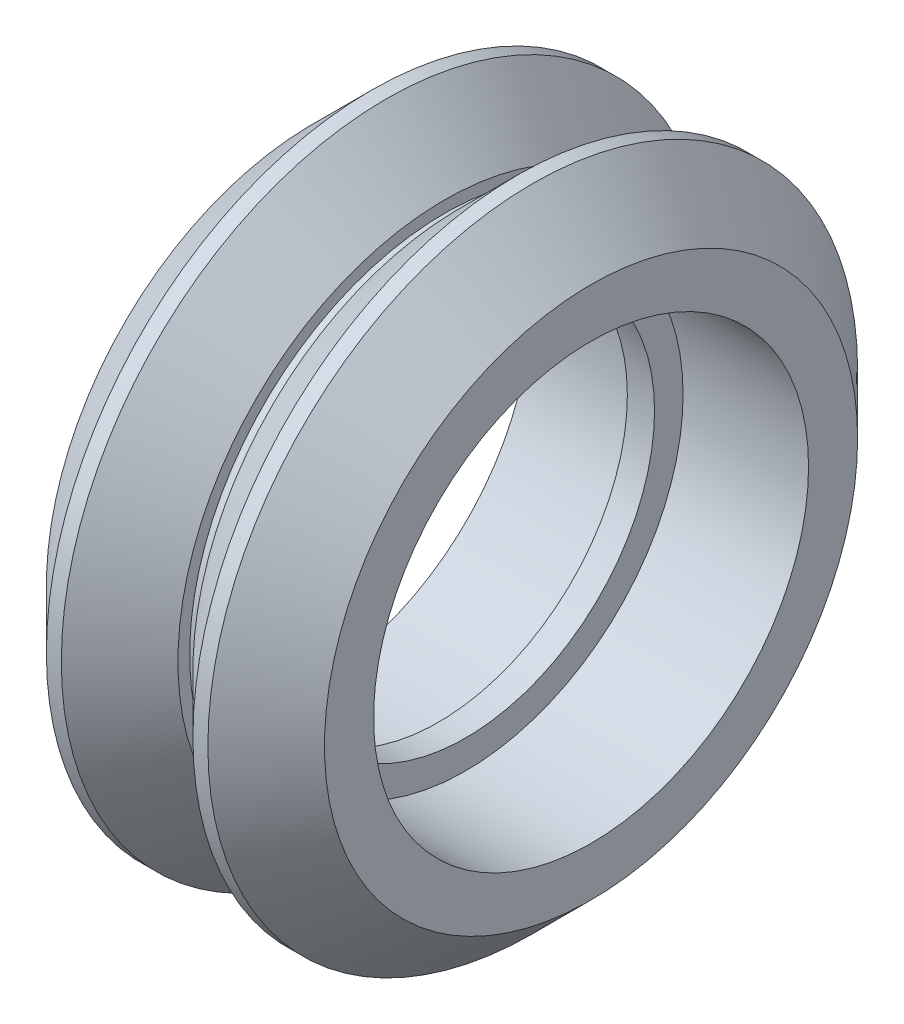
ISO-10303-21;
HEADER;
FILE_DESCRIPTION(('STEP AP214'),'2;1');
FILE_NAME('part.step','',(''),(''),'','','');
FILE_SCHEMA(('AUTOMOTIVE_DESIGN { 1 0 10303 214 1 1 1 1 }'));
ENDSEC;
DATA;
#1=APPLICATION_CONTEXT('core data for automotive mechanical design processes');
#2=APPLICATION_PROTOCOL_DEFINITION('international standard','automotive_design',2000,#1);
#3=PRODUCT_CONTEXT('',#1,'mechanical');
#4=PRODUCT('Part','Part','',(#3));
#5=PRODUCT_RELATED_PRODUCT_CATEGORY('part','',(#4));
#6=PRODUCT_DEFINITION_FORMATION('','',#4);
#7=PRODUCT_DEFINITION_CONTEXT('part definition',#1,'design');
#8=PRODUCT_DEFINITION('design','',#6,#7);
#9=PRODUCT_DEFINITION_SHAPE('','',#8);
#10=(LENGTH_UNIT() NAMED_UNIT(*) SI_UNIT(.MILLI.,.METRE.));
#11=(NAMED_UNIT(*) PLANE_ANGLE_UNIT() SI_UNIT($,.RADIAN.));
#12=(NAMED_UNIT(*) SI_UNIT($,.STERADIAN.) SOLID_ANGLE_UNIT());
#13=UNCERTAINTY_MEASURE_WITH_UNIT(LENGTH_MEASURE(1.E-05),#10,'distance_accuracy_value','');
#14=(GEOMETRIC_REPRESENTATION_CONTEXT(3) GLOBAL_UNCERTAINTY_ASSIGNED_CONTEXT((#13)) GLOBAL_UNIT_ASSIGNED_CONTEXT((#10,
#11,#12)) REPRESENTATION_CONTEXT('',''));
#15=CARTESIAN_POINT('',(0.,0.,0.));
#16=DIRECTION('',(0.,0.,1.));
#17=DIRECTION('',(1.,0.,0.));
#18=AXIS2_PLACEMENT_3D('',#15,#16,#17);
#19=CARTESIAN_POINT('',(-0.499999999999999,6.95,0.));
#20=DIRECTION('',(-1.,0.,0.));
#21=DIRECTION('',(0.,0.,1.));
#22=AXIS2_PLACEMENT_3D('',#19,#20,#21);
#23=PLANE('',#22);
#24=CARTESIAN_POINT('',(-0.499999999999999,0.,0.));
#25=DIRECTION('',(1.,0.,0.));
#26=DIRECTION('',(0.,0.,-1.));
#27=AXIS2_PLACEMENT_3D('',#24,#25,#26);
#28=CIRCLE('',#27,6.95);
#29=CARTESIAN_POINT('',(-0.499999999999999,0.,-6.95));
#30=VERTEX_POINT('',#29);
#31=EDGE_CURVE('E10',#30,#30,#28,.T.);
#32=ORIENTED_EDGE('',*,*,#31,.T.);
#33=EDGE_LOOP('',(#32));
#34=FACE_BOUND('',#33,.T.);
#35=CARTESIAN_POINT('',(-0.499999999999999,0.,0.));
#36=DIRECTION('',(1.,0.,0.));
#37=DIRECTION('',(0.,0.,-1.));
#38=AXIS2_PLACEMENT_3D('',#35,#36,#37);
#39=CIRCLE('',#38,8.);
#40=CARTESIAN_POINT('',(-0.499999999999999,0.,-8.));
#41=VERTEX_POINT('',#40);
#42=EDGE_CURVE('E84',#41,#41,#39,.T.);
#43=ORIENTED_EDGE('',*,*,#42,.F.);
#44=EDGE_LOOP('',(#43));
#45=FACE_BOUND('',#44,.T.);
#46=ADVANCED_FACE('F32',(#34,#45),#23,.T.);
#47=CARTESIAN_POINT('',(0.,0.,0.));
#48=DIRECTION('',(1.,0.,0.));
#49=DIRECTION('',(0.,0.,-1.));
#50=AXIS2_PLACEMENT_3D('',#47,#48,#49);
#51=CYLINDRICAL_SURFACE('',#50,6.95);
#52=CARTESIAN_POINT('',(0.500000000000001,0.,0.));
#53=DIRECTION('',(1.,0.,0.));
#54=DIRECTION('',(0.,0.,-1.));
#55=AXIS2_PLACEMENT_3D('',#52,#53,#54);
#56=CIRCLE('',#55,6.95);
#57=CARTESIAN_POINT('',(0.500000000000001,0.,-6.95));
#58=VERTEX_POINT('',#57);
#59=EDGE_CURVE('E38',#58,#58,#56,.T.);
#60=ORIENTED_EDGE('',*,*,#59,.T.);
#61=EDGE_LOOP('',(#60));
#62=FACE_BOUND('',#61,.T.);
#63=ORIENTED_EDGE('',*,*,#31,.F.);
#64=EDGE_LOOP('',(#63));
#65=FACE_BOUND('',#64,.T.);
#66=ADVANCED_FACE('F92',(#62,#65),#51,.F.);
#67=CARTESIAN_POINT('',(0.500000000000001,6.95,0.));
#68=DIRECTION('',(1.,0.,0.));
#69=DIRECTION('',(0.,0.,-1.));
#70=AXIS2_PLACEMENT_3D('',#67,#68,#69);
#71=PLANE('',#70);
#72=CARTESIAN_POINT('',(0.5,0.,0.));
#73=DIRECTION('',(1.,0.,0.));
#74=DIRECTION('',(0.,0.,-1.));
#75=AXIS2_PLACEMENT_3D('',#72,#73,#74);
#76=CIRCLE('',#75,8.);
#77=CARTESIAN_POINT('',(0.5,0.,-8.));
#78=VERTEX_POINT('',#77);
#79=EDGE_CURVE('E42',#78,#78,#76,.T.);
#80=ORIENTED_EDGE('',*,*,#79,.T.);
#81=EDGE_LOOP('',(#80));
#82=FACE_BOUND('',#81,.T.);
#83=ORIENTED_EDGE('',*,*,#59,.F.);
#84=EDGE_LOOP('',(#83));
#85=FACE_BOUND('',#84,.T.);
#86=ADVANCED_FACE('F96',(#82,#85),#71,.T.);
#87=CARTESIAN_POINT('',(0.,0.,0.));
#88=DIRECTION('',(1.,0.,0.));
#89=DIRECTION('',(0.,0.,-1.));
#90=AXIS2_PLACEMENT_3D('',#87,#88,#89);
#91=CYLINDRICAL_SURFACE('',#90,8.);
#92=CARTESIAN_POINT('',(5.115,0.,0.));
#93=DIRECTION('',(1.,0.,0.));
#94=DIRECTION('',(0.,0.,-1.));
#95=AXIS2_PLACEMENT_3D('',#92,#93,#94);
#96=CIRCLE('',#95,8.);
#97=CARTESIAN_POINT('',(5.115,0.,-8.));
#98=VERTEX_POINT('',#97);
#99=EDGE_CURVE('E46',#98,#98,#96,.T.);
#100=ORIENTED_EDGE('',*,*,#99,.T.);
#101=EDGE_LOOP('',(#100));
#102=FACE_BOUND('',#101,.T.);
#103=ORIENTED_EDGE('',*,*,#79,.F.);
#104=EDGE_LOOP('',(#103));
#105=FACE_BOUND('',#104,.T.);
#106=ADVANCED_FACE('F100',(#102,#105),#91,.F.);
#107=CARTESIAN_POINT('',(5.115,8.,0.));
#108=DIRECTION('',(1.,0.,0.));
#109=DIRECTION('',(0.,0.,-1.));
#110=AXIS2_PLACEMENT_3D('',#107,#108,#109);
#111=PLANE('',#110);
#112=CARTESIAN_POINT('',(5.115,0.,0.));
#113=DIRECTION('',(1.,0.,0.));
#114=DIRECTION('',(0.,0.,-1.));
#115=AXIS2_PLACEMENT_3D('',#112,#113,#114);
#116=CIRCLE('',#115,9.805);
#117=CARTESIAN_POINT('',(5.115,0.,-9.805));
#118=VERTEX_POINT('',#117);
#119=EDGE_CURVE('E51',#118,#118,#116,.T.);
#120=ORIENTED_EDGE('',*,*,#119,.T.);
#121=EDGE_LOOP('',(#120));
#122=FACE_BOUND('',#121,.T.);
#123=ORIENTED_EDGE('',*,*,#99,.F.);
#124=EDGE_LOOP('',(#123));
#125=FACE_BOUND('',#124,.T.);
#126=ADVANCED_FACE('F107',(#122,#125),#111,.T.);
#127=CARTESIAN_POINT('',(5.115,0.,0.));
#128=DIRECTION('',(-1.,0.,0.));
#129=DIRECTION('',(0.,0.,1.));
#130=AXIS2_PLACEMENT_3D('',#127,#128,#129);
#131=CONICAL_SURFACE('',#130,9.805,0.785398163397447);
#132=CARTESIAN_POINT('',(2.96999999999999,0.,0.));
#133=DIRECTION('',(1.,0.,0.));
#134=DIRECTION('',(0.,0.,-1.));
#135=AXIS2_PLACEMENT_3D('',#132,#133,#134);
#136=CIRCLE('',#135,11.95);
#137=CARTESIAN_POINT('',(2.96999999999999,0.,-11.95));
#138=VERTEX_POINT('',#137);
#139=EDGE_CURVE('E54',#138,#138,#136,.T.);
#140=ORIENTED_EDGE('',*,*,#139,.T.);
#141=EDGE_LOOP('',(#140));
#142=FACE_BOUND('',#141,.T.);
#143=ORIENTED_EDGE('',*,*,#119,.F.);
#144=EDGE_LOOP('',(#143));
#145=FACE_BOUND('',#144,.T.);
#146=ADVANCED_FACE('F111',(#142,#145),#131,.T.);
#147=CARTESIAN_POINT('',(0.,0.,0.));
#148=DIRECTION('',(1.,0.,0.));
#149=DIRECTION('',(0.,0.,-1.));
#150=AXIS2_PLACEMENT_3D('',#147,#148,#149);
#151=CYLINDRICAL_SURFACE('',#150,11.95);
#152=CARTESIAN_POINT('',(2.41999999999999,0.,0.));
#153=DIRECTION('',(1.,0.,0.));
#154=DIRECTION('',(0.,0.,-1.));
#155=AXIS2_PLACEMENT_3D('',#152,#153,#154);
#156=CIRCLE('',#155,11.95);
#157=CARTESIAN_POINT('',(2.41999999999999,0.,-11.95));
#158=VERTEX_POINT('',#157);
#159=EDGE_CURVE('E57',#158,#158,#156,.T.);
#160=ORIENTED_EDGE('',*,*,#159,.T.);
#161=EDGE_LOOP('',(#160));
#162=FACE_BOUND('',#161,.T.);
#163=ORIENTED_EDGE('',*,*,#139,.F.);
#164=EDGE_LOOP('',(#163));
#165=FACE_BOUND('',#164,.T.);
#166=ADVANCED_FACE('F115',(#162,#165),#151,.T.);
#167=CARTESIAN_POINT('',(2.41999999999999,0.,0.));
#168=DIRECTION('',(1.,0.,0.));
#169=DIRECTION('',(0.,0.,-1.));
#170=AXIS2_PLACEMENT_3D('',#167,#168,#169);
#171=CONICAL_SURFACE('',#170,11.95,0.785398163397449);
#172=CARTESIAN_POINT('',(0.274999999999998,0.,0.));
#173=DIRECTION('',(1.,0.,0.));
#174=DIRECTION('',(0.,0.,-1.));
#175=AXIS2_PLACEMENT_3D('',#172,#173,#174);
#176=CIRCLE('',#175,9.805);
#177=CARTESIAN_POINT('',(0.274999999999998,0.,-9.805));
#178=VERTEX_POINT('',#177);
#179=EDGE_CURVE('E60',#178,#178,#176,.T.);
#180=ORIENTED_EDGE('',*,*,#179,.T.);
#181=EDGE_LOOP('',(#180));
#182=FACE_BOUND('',#181,.T.);
#183=ORIENTED_EDGE('',*,*,#159,.F.);
#184=EDGE_LOOP('',(#183));
#185=FACE_BOUND('',#184,.T.);
#186=ADVANCED_FACE('F119',(#182,#185),#171,.T.);
#187=CARTESIAN_POINT('',(0.275,9.805,0.));
#188=DIRECTION('',(-1.,0.,0.));
#189=DIRECTION('',(0.,0.,1.));
#190=AXIS2_PLACEMENT_3D('',#187,#188,#189);
#191=PLANE('',#190);
#192=CARTESIAN_POINT('',(0.275000000000003,0.,0.));
#193=DIRECTION('',(1.,0.,0.));
#194=DIRECTION('',(0.,0.,-1.));
#195=AXIS2_PLACEMENT_3D('',#192,#193,#194);
#196=CIRCLE('',#195,9.375);
#197=CARTESIAN_POINT('',(0.275000000000003,0.,-9.375));
#198=VERTEX_POINT('',#197);
#199=EDGE_CURVE('E63',#198,#198,#196,.T.);
#200=ORIENTED_EDGE('',*,*,#199,.T.);
#201=EDGE_LOOP('',(#200));
#202=FACE_BOUND('',#201,.T.);
#203=ORIENTED_EDGE('',*,*,#179,.F.);
#204=EDGE_LOOP('',(#203));
#205=FACE_BOUND('',#204,.T.);
#206=ADVANCED_FACE('F123',(#202,#205),#191,.T.);
#207=CARTESIAN_POINT('',(0.,0.,0.));
#208=DIRECTION('',(1.,0.,0.));
#209=DIRECTION('',(0.,0.,-1.));
#210=AXIS2_PLACEMENT_3D('',#207,#208,#209);
#211=CYLINDRICAL_SURFACE('',#210,9.375);
#212=CARTESIAN_POINT('',(-0.274999999999998,0.,0.));
#213=DIRECTION('',(1.,0.,0.));
#214=DIRECTION('',(0.,0.,-1.));
#215=AXIS2_PLACEMENT_3D('',#212,#213,#214);
#216=CIRCLE('',#215,9.375);
#217=CARTESIAN_POINT('',(-0.274999999999998,0.,-9.375));
#218=VERTEX_POINT('',#217);
#219=EDGE_CURVE('E66',#218,#218,#216,.T.);
#220=ORIENTED_EDGE('',*,*,#219,.T.);
#221=EDGE_LOOP('',(#220));
#222=FACE_BOUND('',#221,.T.);
#223=ORIENTED_EDGE('',*,*,#199,.F.);
#224=EDGE_LOOP('',(#223));
#225=FACE_BOUND('',#224,.T.);
#226=ADVANCED_FACE('F127',(#222,#225),#211,.T.);
#227=CARTESIAN_POINT('',(-0.274999999999998,9.805,0.));
#228=DIRECTION('',(1.,0.,0.));
#229=DIRECTION('',(0.,0.,-1.));
#230=AXIS2_PLACEMENT_3D('',#227,#228,#229);
#231=PLANE('',#230);
#232=CARTESIAN_POINT('',(-0.274999999999998,0.,0.));
#233=DIRECTION('',(1.,0.,0.));
#234=DIRECTION('',(0.,0.,-1.));
#235=AXIS2_PLACEMENT_3D('',#232,#233,#234);
#236=CIRCLE('',#235,9.805);
#237=CARTESIAN_POINT('',(-0.274999999999998,0.,-9.805));
#238=VERTEX_POINT('',#237);
#239=EDGE_CURVE('E69',#238,#238,#236,.T.);
#240=ORIENTED_EDGE('',*,*,#239,.T.);
#241=EDGE_LOOP('',(#240));
#242=FACE_BOUND('',#241,.T.);
#243=ORIENTED_EDGE('',*,*,#219,.F.);
#244=EDGE_LOOP('',(#243));
#245=FACE_BOUND('',#244,.T.);
#246=ADVANCED_FACE('F131',(#242,#245),#231,.T.);
#247=CARTESIAN_POINT('',(-0.274999999999998,0.,0.));
#248=DIRECTION('',(-1.,0.,0.));
#249=DIRECTION('',(0.,0.,1.));
#250=AXIS2_PLACEMENT_3D('',#247,#248,#249);
#251=CONICAL_SURFACE('',#250,9.805,0.785398163397449);
#252=CARTESIAN_POINT('',(-2.41999999999999,0.,0.));
#253=DIRECTION('',(1.,0.,0.));
#254=DIRECTION('',(0.,0.,-1.));
#255=AXIS2_PLACEMENT_3D('',#252,#253,#254);
#256=CIRCLE('',#255,11.95);
#257=CARTESIAN_POINT('',(-2.41999999999999,0.,-11.95));
#258=VERTEX_POINT('',#257);
#259=EDGE_CURVE('E72',#258,#258,#256,.T.);
#260=ORIENTED_EDGE('',*,*,#259,.T.);
#261=EDGE_LOOP('',(#260));
#262=FACE_BOUND('',#261,.T.);
#263=ORIENTED_EDGE('',*,*,#239,.F.);
#264=EDGE_LOOP('',(#263));
#265=FACE_BOUND('',#264,.T.);
#266=ADVANCED_FACE('F135',(#262,#265),#251,.T.);
#267=CARTESIAN_POINT('',(0.,0.,0.));
#268=DIRECTION('',(1.,0.,0.));
#269=DIRECTION('',(0.,0.,-1.));
#270=AXIS2_PLACEMENT_3D('',#267,#268,#269);
#271=CYLINDRICAL_SURFACE('',#270,11.95);
#272=CARTESIAN_POINT('',(-2.96999999999999,0.,0.));
#273=DIRECTION('',(1.,0.,0.));
#274=DIRECTION('',(0.,0.,-1.));
#275=AXIS2_PLACEMENT_3D('',#272,#273,#274);
#276=CIRCLE('',#275,11.95);
#277=CARTESIAN_POINT('',(-2.96999999999999,0.,-11.95));
#278=VERTEX_POINT('',#277);
#279=EDGE_CURVE('E75',#278,#278,#276,.T.);
#280=ORIENTED_EDGE('',*,*,#279,.T.);
#281=EDGE_LOOP('',(#280));
#282=FACE_BOUND('',#281,.T.);
#283=ORIENTED_EDGE('',*,*,#259,.F.);
#284=EDGE_LOOP('',(#283));
#285=FACE_BOUND('',#284,.T.);
#286=ADVANCED_FACE('F139',(#282,#285),#271,.T.);
#287=CARTESIAN_POINT('',(-2.96999999999999,0.,0.));
#288=DIRECTION('',(1.,0.,0.));
#289=DIRECTION('',(0.,0.,-1.));
#290=AXIS2_PLACEMENT_3D('',#287,#288,#289);
#291=CONICAL_SURFACE('',#290,11.95,0.785398163397447);
#292=CARTESIAN_POINT('',(-5.115,0.,0.));
#293=DIRECTION('',(1.,0.,0.));
#294=DIRECTION('',(0.,0.,-1.));
#295=AXIS2_PLACEMENT_3D('',#292,#293,#294);
#296=CIRCLE('',#295,9.805);
#297=CARTESIAN_POINT('',(-5.115,0.,-9.805));
#298=VERTEX_POINT('',#297);
#299=EDGE_CURVE('E78',#298,#298,#296,.T.);
#300=ORIENTED_EDGE('',*,*,#299,.T.);
#301=EDGE_LOOP('',(#300));
#302=FACE_BOUND('',#301,.T.);
#303=ORIENTED_EDGE('',*,*,#279,.F.);
#304=EDGE_LOOP('',(#303));
#305=FACE_BOUND('',#304,.T.);
#306=ADVANCED_FACE('F143',(#302,#305),#291,.T.);
#307=CARTESIAN_POINT('',(-5.115,8.,0.));
#308=DIRECTION('',(-1.,0.,0.));
#309=DIRECTION('',(0.,0.,1.));
#310=AXIS2_PLACEMENT_3D('',#307,#308,#309);
#311=PLANE('',#310);
#312=CARTESIAN_POINT('',(-5.115,0.,0.));
#313=DIRECTION('',(1.,0.,0.));
#314=DIRECTION('',(0.,0.,-1.));
#315=AXIS2_PLACEMENT_3D('',#312,#313,#314);
#316=CIRCLE('',#315,8.);
#317=CARTESIAN_POINT('',(-5.115,0.,-8.));
#318=VERTEX_POINT('',#317);
#319=EDGE_CURVE('E81',#318,#318,#316,.T.);
#320=ORIENTED_EDGE('',*,*,#319,.T.);
#321=EDGE_LOOP('',(#320));
#322=FACE_BOUND('',#321,.T.);
#323=ORIENTED_EDGE('',*,*,#299,.F.);
#324=EDGE_LOOP('',(#323));
#325=FACE_BOUND('',#324,.T.);
#326=ADVANCED_FACE('F147',(#322,#325),#311,.T.);
#327=CARTESIAN_POINT('',(0.,0.,0.));
#328=DIRECTION('',(1.,0.,0.));
#329=DIRECTION('',(0.,0.,-1.));
#330=AXIS2_PLACEMENT_3D('',#327,#328,#329);
#331=CYLINDRICAL_SURFACE('',#330,8.);
#332=ORIENTED_EDGE('',*,*,#42,.T.);
#333=EDGE_LOOP('',(#332));
#334=FACE_BOUND('',#333,.T.);
#335=ORIENTED_EDGE('',*,*,#319,.F.);
#336=EDGE_LOOP('',(#335));
#337=FACE_BOUND('',#336,.T.);
#338=ADVANCED_FACE('F88',(#334,#337),#331,.F.);
#339=CLOSED_SHELL('',(#46,#66,#86,#106,#126,#146,#166,#186,#206,#226,#246,#266,#286,#306,#326,#338));
#340=MANIFOLD_SOLID_BREP('B2',#339);
#341=ADVANCED_BREP_SHAPE_REPRESENTATION('',(#18,#340),#14);
#342=SHAPE_DEFINITION_REPRESENTATION(#9,#341);
ENDSEC;
END-ISO-10303-21;
